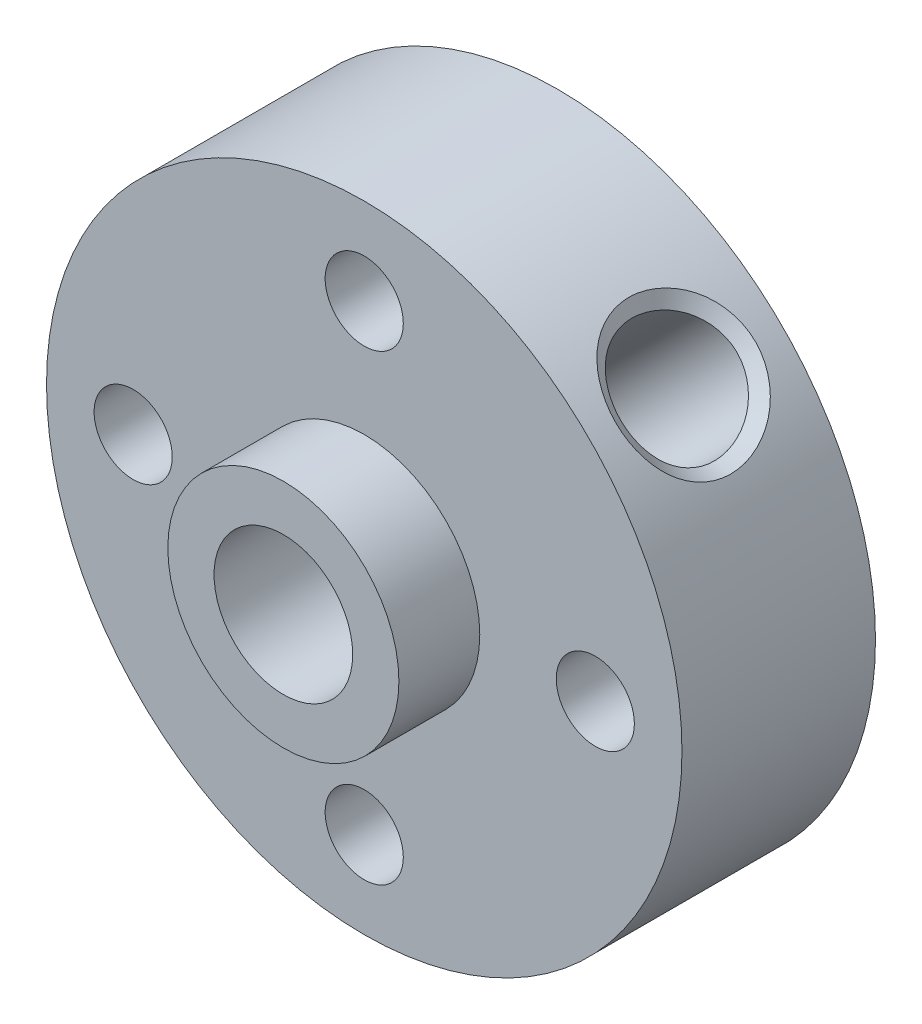
ISO-10303-21;
HEADER;
FILE_DESCRIPTION(('STEP AP214'),'2;1');
FILE_NAME('part.step','',(''),(''),'','','');
FILE_SCHEMA(('AUTOMOTIVE_DESIGN { 1 0 10303 214 1 1 1 1 }'));
ENDSEC;
DATA;
#1=APPLICATION_CONTEXT('core data for automotive mechanical design processes');
#2=APPLICATION_PROTOCOL_DEFINITION('international standard','automotive_design',2000,#1);
#3=PRODUCT_CONTEXT('',#1,'mechanical');
#4=PRODUCT('Part','Part','',(#3));
#5=PRODUCT_RELATED_PRODUCT_CATEGORY('part','',(#4));
#6=PRODUCT_DEFINITION_FORMATION('','',#4);
#7=PRODUCT_DEFINITION_CONTEXT('part definition',#1,'design');
#8=PRODUCT_DEFINITION('design','',#6,#7);
#9=PRODUCT_DEFINITION_SHAPE('','',#8);
#10=(LENGTH_UNIT() NAMED_UNIT(*) SI_UNIT(.MILLI.,.METRE.));
#11=(NAMED_UNIT(*) PLANE_ANGLE_UNIT() SI_UNIT($,.RADIAN.));
#12=(NAMED_UNIT(*) SI_UNIT($,.STERADIAN.) SOLID_ANGLE_UNIT());
#13=UNCERTAINTY_MEASURE_WITH_UNIT(LENGTH_MEASURE(1.E-05),#10,'distance_accuracy_value','');
#14=(GEOMETRIC_REPRESENTATION_CONTEXT(3) GLOBAL_UNCERTAINTY_ASSIGNED_CONTEXT((#13)) GLOBAL_UNIT_ASSIGNED_CONTEXT((#10,
#11,#12)) REPRESENTATION_CONTEXT('',''));
#15=CARTESIAN_POINT('',(0.,0.,0.));
#16=DIRECTION('',(0.,0.,1.));
#17=DIRECTION('',(1.,0.,0.));
#18=AXIS2_PLACEMENT_3D('',#15,#16,#17);
#19=CARTESIAN_POINT('',(0.,0.,3.35));
#20=DIRECTION('',(0.,0.,1.));
#21=DIRECTION('',(1.,0.,0.));
#22=AXIS2_PLACEMENT_3D('',#19,#20,#21);
#23=PLANE('',#22);
#24=CARTESIAN_POINT('',(0.,8.,3.35));
#25=DIRECTION('',(0.,0.,1.));
#26=DIRECTION('',(1.,0.,0.));
#27=AXIS2_PLACEMENT_3D('',#24,#25,#26);
#28=CIRCLE('',#27,1.35254999999999);
#29=CARTESIAN_POINT('',(1.35254999999999,8.,3.35));
#30=VERTEX_POINT('',#29);
#31=EDGE_CURVE('E180',#30,#30,#28,.T.);
#32=ORIENTED_EDGE('',*,*,#31,.F.);
#33=EDGE_LOOP('',(#32));
#34=FACE_BOUND('',#33,.T.);
#35=CARTESIAN_POINT('',(-8.,0.,3.35));
#36=DIRECTION('',(0.,0.,1.));
#37=DIRECTION('',(1.,0.,0.));
#38=AXIS2_PLACEMENT_3D('',#35,#36,#37);
#39=CIRCLE('',#38,1.35254999999999);
#40=CARTESIAN_POINT('',(-6.64745000000001,0.,3.35));
#41=VERTEX_POINT('',#40);
#42=EDGE_CURVE('E172',#41,#41,#39,.T.);
#43=ORIENTED_EDGE('',*,*,#42,.F.);
#44=EDGE_LOOP('',(#43));
#45=FACE_BOUND('',#44,.T.);
#46=CARTESIAN_POINT('',(8.,0.,3.35));
#47=DIRECTION('',(0.,0.,1.));
#48=DIRECTION('',(1.,0.,0.));
#49=AXIS2_PLACEMENT_3D('',#46,#47,#48);
#50=CIRCLE('',#49,1.35254999999999);
#51=CARTESIAN_POINT('',(9.35254999999999,0.,3.35));
#52=VERTEX_POINT('',#51);
#53=EDGE_CURVE('E167',#52,#52,#50,.T.);
#54=ORIENTED_EDGE('',*,*,#53,.F.);
#55=EDGE_LOOP('',(#54));
#56=FACE_BOUND('',#55,.T.);
#57=CARTESIAN_POINT('',(0.,-8.,3.35));
#58=DIRECTION('',(0.,0.,1.));
#59=DIRECTION('',(1.,0.,0.));
#60=AXIS2_PLACEMENT_3D('',#57,#58,#59);
#61=CIRCLE('',#60,1.35254999999999);
#62=CARTESIAN_POINT('',(1.35254999999999,-8.,3.35));
#63=VERTEX_POINT('',#62);
#64=EDGE_CURVE('E94',#63,#63,#61,.T.);
#65=ORIENTED_EDGE('',*,*,#64,.F.);
#66=EDGE_LOOP('',(#65));
#67=FACE_BOUND('',#66,.T.);
#68=CARTESIAN_POINT('',(0.,0.,3.35));
#69=DIRECTION('',(0.,0.,1.));
#70=DIRECTION('',(1.,0.,0.));
#71=AXIS2_PLACEMENT_3D('',#68,#69,#70);
#72=CIRCLE('',#71,11.);
#73=CARTESIAN_POINT('',(11.,0.,3.35));
#74=VERTEX_POINT('',#73);
#75=EDGE_CURVE('E55',#74,#74,#72,.T.);
#76=ORIENTED_EDGE('',*,*,#75,.T.);
#77=EDGE_LOOP('',(#76));
#78=FACE_BOUND('',#77,.T.);
#79=CARTESIAN_POINT('',(0.,0.,3.35));
#80=DIRECTION('',(0.,0.,1.));
#81=DIRECTION('',(1.,0.,0.));
#82=AXIS2_PLACEMENT_3D('',#79,#80,#81);
#83=CIRCLE('',#82,4.);
#84=CARTESIAN_POINT('',(4.,0.,3.35));
#85=VERTEX_POINT('',#84);
#86=EDGE_CURVE('E63',#85,#85,#83,.T.);
#87=ORIENTED_EDGE('',*,*,#86,.F.);
#88=EDGE_LOOP('',(#87));
#89=FACE_BOUND('',#88,.T.);
#90=ADVANCED_FACE('F33',(#34,#45,#56,#67,#78,#89),#23,.T.);
#91=CARTESIAN_POINT('',(0.,0.,-3.35));
#92=DIRECTION('',(0.,0.,1.));
#93=DIRECTION('',(1.,0.,0.));
#94=AXIS2_PLACEMENT_3D('',#91,#92,#93);
#95=CYLINDRICAL_SURFACE('',#94,11.);
#96=CARTESIAN_POINT('',(5.80850921114971,9.34137145948008,0.));
#97=CARTESIAN_POINT('',(5.80860175270186,9.34130684226353,0.637752239425175));
#98=CARTESIAN_POINT('',(6.04841944563921,9.19795689630476,1.26506432985481));
#99=CARTESIAN_POINT('',(6.80772994268232,8.6547578245762,2.15935304443139));
#100=CARTESIAN_POINT('',(7.31255506753503,8.24383991985221,2.42181611028021));
#101=CARTESIAN_POINT('',(8.24208780154511,7.31421539613682,2.42137394363942));
#102=CARTESIAN_POINT('',(8.65342910417239,6.80927509037896,2.16023058528546));
#103=CARTESIAN_POINT('',(9.19833006953286,6.04820111625002,1.26575073384544));
#104=CARTESIAN_POINT('',(9.34130756360717,5.80859981124356,0.640244269694805));
#105=CARTESIAN_POINT('',(9.34143535072447,5.80841861849954,-0.63996115444347));
#106=CARTESIAN_POINT('',(9.19862099961547,6.04773368941902,-1.26485137218771));
#107=CARTESIAN_POINT('',(8.65403117260026,6.8085025567722,-2.15966842361701));
#108=CARTESIAN_POINT('',(8.24214650834188,7.31418190369823,-2.42143639363605));
#109=CARTESIAN_POINT('',(7.31242801405934,8.24394174367863,-2.42175361413117));
#110=CARTESIAN_POINT('',(6.80825671047602,8.65433029295559,-2.15959971653594));
#111=CARTESIAN_POINT('',(6.04869975760828,9.19780320357039,-1.26576913530237));
#112=CARTESIAN_POINT('',(5.80841666959756,9.34143607669663,-0.637752239425176));
#113=CARTESIAN_POINT('',(5.80850921114971,9.34137145948008,0.));
#114=B_SPLINE_CURVE_WITH_KNOTS('',3,(#96,#97,#98,#99,#100,#101,#102,#103,#104,#105,#106,#107,
#108,#109,#110,#111,#112,#113),.UNSPECIFIED.,.T.,.F.,(4,2,2,2,2,2,2,2,4),(-3.18999496817969E-06,
0.00189587305523977,0.00379493610544773,0.00569399915565568,0.00759306220586363,
0.00949212525607159,0.0113911883062795,0.0132902513564875,0.0151893144066954),.UNSPECIFIED.);
#115=CARTESIAN_POINT('',(5.80850921114971,9.34137145948008,0.));
#116=VERTEX_POINT('',#115);
#117=EDGE_CURVE('E10',#116,#116,#114,.F.);
#118=ORIENTED_EDGE('',*,*,#117,.T.);
#119=EDGE_LOOP('',(#118));
#120=FACE_BOUND('',#119,.T.);
#121=CARTESIAN_POINT('',(0.,0.,-3.35));
#122=DIRECTION('',(0.,0.,1.));
#123=DIRECTION('',(1.,0.,0.));
#124=AXIS2_PLACEMENT_3D('',#121,#122,#123);
#125=CIRCLE('',#124,11.);
#126=CARTESIAN_POINT('',(11.,0.,-3.35));
#127=VERTEX_POINT('',#126);
#128=EDGE_CURVE('E50',#127,#127,#125,.T.);
#129=ORIENTED_EDGE('',*,*,#128,.T.);
#130=EDGE_LOOP('',(#129));
#131=FACE_BOUND('',#130,.T.);
#132=ORIENTED_EDGE('',*,*,#75,.F.);
#133=EDGE_LOOP('',(#132));
#134=FACE_BOUND('',#133,.T.);
#135=ADVANCED_FACE('F109',(#120,#131,#134),#95,.T.);
#136=CARTESIAN_POINT('',(0.,0.,-3.35));
#137=DIRECTION('',(0.,0.,1.));
#138=DIRECTION('',(1.,0.,0.));
#139=AXIS2_PLACEMENT_3D('',#136,#137,#138);
#140=PLANE('',#139);
#141=CARTESIAN_POINT('',(0.,8.,-3.35));
#142=DIRECTION('',(0.,0.,1.));
#143=DIRECTION('',(1.,0.,0.));
#144=AXIS2_PLACEMENT_3D('',#141,#142,#143);
#145=CIRCLE('',#144,1.35255);
#146=CARTESIAN_POINT('',(1.35255,8.,-3.35));
#147=VERTEX_POINT('',#146);
#148=EDGE_CURVE('E183',#147,#147,#145,.T.);
#149=ORIENTED_EDGE('',*,*,#148,.T.);
#150=EDGE_LOOP('',(#149));
#151=FACE_BOUND('',#150,.T.);
#152=CARTESIAN_POINT('',(-8.,0.,-3.35));
#153=DIRECTION('',(0.,0.,1.));
#154=DIRECTION('',(1.,0.,0.));
#155=AXIS2_PLACEMENT_3D('',#152,#153,#154);
#156=CIRCLE('',#155,1.35255);
#157=CARTESIAN_POINT('',(-6.64745,0.,-3.35));
#158=VERTEX_POINT('',#157);
#159=EDGE_CURVE('E177',#158,#158,#156,.T.);
#160=ORIENTED_EDGE('',*,*,#159,.T.);
#161=EDGE_LOOP('',(#160));
#162=FACE_BOUND('',#161,.T.);
#163=CARTESIAN_POINT('',(8.,0.,-3.35));
#164=DIRECTION('',(0.,0.,1.));
#165=DIRECTION('',(1.,0.,0.));
#166=AXIS2_PLACEMENT_3D('',#163,#164,#165);
#167=CIRCLE('',#166,1.35255);
#168=CARTESIAN_POINT('',(9.35255,0.,-3.35));
#169=VERTEX_POINT('',#168);
#170=EDGE_CURVE('E164',#169,#169,#167,.T.);
#171=ORIENTED_EDGE('',*,*,#170,.T.);
#172=EDGE_LOOP('',(#171));
#173=FACE_BOUND('',#172,.T.);
#174=CARTESIAN_POINT('',(0.,-8.,-3.35));
#175=DIRECTION('',(0.,0.,1.));
#176=DIRECTION('',(1.,0.,0.));
#177=AXIS2_PLACEMENT_3D('',#174,#175,#176);
#178=CIRCLE('',#177,1.35255);
#179=CARTESIAN_POINT('',(1.35255,-8.,-3.35));
#180=VERTEX_POINT('',#179);
#181=EDGE_CURVE('E169',#180,#180,#178,.T.);
#182=ORIENTED_EDGE('',*,*,#181,.T.);
#183=EDGE_LOOP('',(#182));
#184=FACE_BOUND('',#183,.T.);
#185=CARTESIAN_POINT('',(0.,0.,-3.35));
#186=DIRECTION('',(0.,0.,1.));
#187=DIRECTION('',(1.,0.,0.));
#188=AXIS2_PLACEMENT_3D('',#185,#186,#187);
#189=CIRCLE('',#188,2.4);
#190=CARTESIAN_POINT('',(2.4,0.,-3.35));
#191=VERTEX_POINT('',#190);
#192=EDGE_CURVE('E96',#191,#191,#189,.T.);
#193=ORIENTED_EDGE('',*,*,#192,.T.);
#194=EDGE_LOOP('',(#193));
#195=FACE_BOUND('',#194,.T.);
#196=ORIENTED_EDGE('',*,*,#128,.F.);
#197=EDGE_LOOP('',(#196));
#198=FACE_BOUND('',#197,.T.);
#199=ADVANCED_FACE('F115',(#151,#162,#173,#184,#195,#198),#140,.F.);
#200=CARTESIAN_POINT('',(0.,0.,6.15));
#201=DIRECTION('',(0.,0.,-1.));
#202=DIRECTION('',(-1.,0.,0.));
#203=AXIS2_PLACEMENT_3D('',#200,#201,#202);
#204=CYLINDRICAL_SURFACE('',#203,4.);
#205=CARTESIAN_POINT('',(0.,0.,6.15));
#206=DIRECTION('',(0.,0.,1.));
#207=DIRECTION('',(1.,0.,0.));
#208=AXIS2_PLACEMENT_3D('',#205,#206,#207);
#209=CIRCLE('',#208,4.);
#210=CARTESIAN_POINT('',(4.,0.,6.15));
#211=VERTEX_POINT('',#210);
#212=EDGE_CURVE('E60',#211,#211,#209,.T.);
#213=ORIENTED_EDGE('',*,*,#212,.F.);
#214=EDGE_LOOP('',(#213));
#215=FACE_BOUND('',#214,.T.);
#216=ORIENTED_EDGE('',*,*,#86,.T.);
#217=EDGE_LOOP('',(#216));
#218=FACE_BOUND('',#217,.T.);
#219=ADVANCED_FACE('F106',(#215,#218),#204,.T.);
#220=CARTESIAN_POINT('',(0.,0.,6.15));
#221=DIRECTION('',(0.,0.,1.));
#222=DIRECTION('',(1.,0.,0.));
#223=AXIS2_PLACEMENT_3D('',#220,#221,#222);
#224=PLANE('',#223);
#225=CARTESIAN_POINT('',(0.,0.,6.15));
#226=DIRECTION('',(0.,0.,1.));
#227=DIRECTION('',(1.,0.,0.));
#228=AXIS2_PLACEMENT_3D('',#225,#226,#227);
#229=CIRCLE('',#228,2.4);
#230=CARTESIAN_POINT('',(2.4,0.,6.15));
#231=VERTEX_POINT('',#230);
#232=EDGE_CURVE('E93',#231,#231,#229,.T.);
#233=ORIENTED_EDGE('',*,*,#232,.F.);
#234=EDGE_LOOP('',(#233));
#235=FACE_BOUND('',#234,.T.);
#236=ORIENTED_EDGE('',*,*,#212,.T.);
#237=EDGE_LOOP('',(#236));
#238=FACE_BOUND('',#237,.T.);
#239=ADVANCED_FACE('F198',(#235,#238),#224,.T.);
#240=CARTESIAN_POINT('',(0.,0.,-3.35));
#241=DIRECTION('',(0.,0.,1.));
#242=DIRECTION('',(1.,0.,0.));
#243=AXIS2_PLACEMENT_3D('',#240,#241,#242);
#244=CYLINDRICAL_SURFACE('',#243,2.4);
#245=CARTESIAN_POINT('',(2.4,0.,-1.09433655243713));
#246=CARTESIAN_POINT('',(2.39999549677408,0.0918258954439171,-1.19504751534314));
#247=CARTESIAN_POINT('',(2.39468581076607,0.190550179248583,-1.28957303433403));
#248=CARTESIAN_POINT('',(2.369167262945,0.397415738785247,-1.46565348204902));
#249=CARTESIAN_POINT('',(2.3489510225727,0.505561654721847,-1.54720196298737));
#250=CARTESIAN_POINT('',(2.2961878181119,0.704092495070362,-1.67920338801804));
#251=CARTESIAN_POINT('',(2.26712119925325,0.793438846857645,-1.73259020418202));
#252=CARTESIAN_POINT('',(2.19596057742005,0.973168402780957,-1.82757870174769));
#253=CARTESIAN_POINT('',(2.15388927549888,1.06354953789234,-1.86920067941086));
#254=CARTESIAN_POINT('',(2.06347262158125,1.22863264617417,-1.9330857225613));
#255=CARTESIAN_POINT('',(2.01706533869137,1.30362198706416,-1.9573340458837));
#256=CARTESIAN_POINT('',(1.91466986499154,1.44982281978823,-1.99438783770254));
#257=CARTESIAN_POINT('',(1.85868616144868,1.52103606062612,-2.00719864812017));
#258=CARTESIAN_POINT('',(1.73814609656906,1.65745379384576,-2.0205531845462));
#259=CARTESIAN_POINT('',(1.67356653390496,1.72264118497492,-2.02106300470413));
#260=CARTESIAN_POINT('',(1.53797914495771,1.84470717951664,-2.00969277868068));
#261=CARTESIAN_POINT('',(1.46697072364594,1.9015850125548,-1.9978115845654));
#262=CARTESIAN_POINT('',(1.32399721547764,2.00360520801464,-1.96319299119062));
#263=CARTESIAN_POINT('',(1.25219165125774,2.04913408506368,-1.94092229674205));
#264=CARTESIAN_POINT('',(1.1070014698224,2.13108215689419,-1.88690050053406));
#265=CARTESIAN_POINT('',(1.03361612775899,2.16749706881726,-1.85514495694595));
#266=CARTESIAN_POINT('',(0.85994663818204,2.2433175863967,-1.77017444356637));
#267=CARTESIAN_POINT('',(0.759734181670304,2.27886397472941,-1.7133651848094));
#268=CARTESIAN_POINT('',(0.56309632934406,2.33525777989147,-1.5872394707011));
#269=CARTESIAN_POINT('',(0.46667799556754,2.35607890720128,-1.51790092197272));
#270=CARTESIAN_POINT('',(0.278879458097049,2.38566615723369,-1.36749948627123));
#271=CARTESIAN_POINT('',(0.187608194494958,2.39422838462626,-1.28626252954375));
#272=CARTESIAN_POINT('',(0.0146327458766225,2.4015091621865,-1.11377589004947));
#273=CARTESIAN_POINT('',(-0.0670737997805187,2.40023014646564,-1.02252868869816));
#274=CARTESIAN_POINT('',(-0.197962775585905,2.39248322236102,-0.853801778164708));
#275=CARTESIAN_POINT('',(-0.250165267217843,2.38739547558387,-0.778599565121305));
#276=CARTESIAN_POINT('',(-0.343798396458399,2.37571350999456,-0.621820492340616));
#277=CARTESIAN_POINT('',(-0.385247938896625,2.3691219738931,-0.540255152704692));
#278=CARTESIAN_POINT('',(-0.443801011289591,2.35874751402488,-0.393099704378681));
#279=CARTESIAN_POINT('',(-0.464441983483004,2.35468224015414,-0.328965581597192));
#280=CARTESIAN_POINT('',(-0.495011359266389,2.34844961432166,-0.19815347061405));
#281=CARTESIAN_POINT('',(-0.504965458352082,2.34627771231763,-0.131481985112074));
#282=CARTESIAN_POINT('',(-0.512708670349231,2.34460061057782,0.0030122508888446));
#283=CARTESIAN_POINT('',(-0.510428954605099,2.34511049853825,0.0708393705218476));
#284=CARTESIAN_POINT('',(-0.493930084776009,2.34863671309948,0.204991368188147));
#285=CARTESIAN_POINT('',(-0.479690814832164,2.35165726252071,0.271313521732825));
#286=CARTESIAN_POINT('',(-0.435142961394895,2.36036040022229,0.421511686914182));
#287=CARTESIAN_POINT('',(-0.401156031918268,2.36658493491141,0.504233980851543));
#288=CARTESIAN_POINT('',(-0.320904833138461,2.37879471937154,0.663600485910364));
#289=CARTESIAN_POINT('',(-0.274596562429394,2.38477902129586,0.740221608784293));
#290=CARTESIAN_POINT('',(-0.184045497955121,2.39327060162296,0.871956115918708));
#291=CARTESIAN_POINT('',(-0.14144280205973,2.39624587375274,0.92818754157932));
#292=CARTESIAN_POINT('',(-0.0519398420575724,2.39985704074935,1.03721493488172));
#293=CARTESIAN_POINT('',(-0.00503725171330568,2.40049166158102,1.09000901619721));
#294=CARTESIAN_POINT('',(0.14083402262038,2.39782922251128,1.2433524644827));
#295=CARTESIAN_POINT('',(0.245054200715936,2.38997684845191,1.33898500860759));
#296=CARTESIAN_POINT('',(0.447019822375516,2.35989329853952,1.50315571365506));
#297=CARTESIAN_POINT('',(0.543547348000516,2.33988782761346,1.57361261542774));
#298=CARTESIAN_POINT('',(0.740642674440521,2.28513716448287,1.70200961270045));
#299=CARTESIAN_POINT('',(0.841202317487256,2.25042049607641,1.75997360452849));
#300=CARTESIAN_POINT('',(1.02242016523822,2.1730852861859,1.85033396919466));
#301=CARTESIAN_POINT('',(1.10297091238072,2.13350512786098,1.88553226766972));
#302=CARTESIAN_POINT('',(1.26214331511997,2.04336388088066,1.94448891886619));
#303=CARTESIAN_POINT('',(1.34076609081766,1.99280934475451,1.96825407092077));
#304=CARTESIAN_POINT('',(1.49377030482187,1.88087154204424,2.00293964410296));
#305=CARTESIAN_POINT('',(1.56812497854421,1.81942812536219,2.01378599005086));
#306=CARTESIAN_POINT('',(1.70921571925083,1.68757030017141,2.02154777923062));
#307=CARTESIAN_POINT('',(1.77595394373701,1.6171584441599,2.01846717762351));
#308=CARTESIAN_POINT('',(1.89385111836663,1.47680439608037,1.99956328386563));
#309=CARTESIAN_POINT('',(1.94588020475627,1.40742154143652,1.98494538809918));
#310=CARTESIAN_POINT('',(2.04097872683706,1.26558348310351,1.94534517584651));
#311=CARTESIAN_POINT('',(2.08404680312482,1.19312781526647,1.9203612885371));
#312=CARTESIAN_POINT('',(2.16320019292288,1.0431445602755,1.85962583643449));
#313=CARTESIAN_POINT('',(2.19876985386715,0.965557523070692,1.82335672335069));
#314=CARTESIAN_POINT('',(2.26029878185005,0.811154867897669,1.74214078223415));
#315=CARTESIAN_POINT('',(2.28625208715777,0.734339757100534,1.69718859724716));
#316=CARTESIAN_POINT('',(2.33982449451597,0.546611683105258,1.57649497874268));
#317=CARTESIAN_POINT('',(2.36225386192885,0.437046456555988,1.49633684053456));
#318=CARTESIAN_POINT('',(2.39163239097249,0.226704657923942,1.32247275514879));
#319=CARTESIAN_POINT('',(2.39854112053262,0.125951696152554,1.2287320986696));
#320=CARTESIAN_POINT('',(2.40085987505948,-0.0489525954614862,1.04283976476142));
#321=CARTESIAN_POINT('',(2.39775764782871,-0.124850952535787,0.952337558210139));
#322=CARTESIAN_POINT('',(2.38658778617655,-0.262497870449791,0.761453378495307));
#323=CARTESIAN_POINT('',(2.3785359102636,-0.324290487785901,0.66110360636626));
#324=CARTESIAN_POINT('',(2.36576243399885,-0.405117869885077,0.492845705525591));
#325=CARTESIAN_POINT('',(2.36102335039097,-0.431309408345181,0.428420074253314));
#326=CARTESIAN_POINT('',(2.35293124174405,-0.473473491997229,0.29627609547871));
#327=CARTESIAN_POINT('',(2.34957463084623,-0.48947253426043,0.22856678224992));
#328=CARTESIAN_POINT('',(2.34539787602257,-0.509143249846498,0.0905198234930237));
#329=CARTESIAN_POINT('',(2.34460333538734,-0.51269052096264,0.0201627131590107));
#330=CARTESIAN_POINT('',(2.34595711321856,-0.506447675999942,-0.119965883355894));
#331=CARTESIAN_POINT('',(2.34810864156523,-0.496643012426334,-0.189736647309032));
#332=CARTESIAN_POINT('',(2.35503790579702,-0.462739687458018,-0.33781243559993));
#333=CARTESIAN_POINT('',(2.36019423804237,-0.43652723392848,-0.41559666127126));
#334=CARTESIAN_POINT('',(2.37117600828219,-0.372259224836509,-0.566045820751056));
#335=CARTESIAN_POINT('',(2.37700306318634,-0.334174655408325,-0.63869767231639));
#336=CARTESIAN_POINT('',(2.38730091370058,-0.250126569928135,-0.777813003742594));
#337=CARTESIAN_POINT('',(2.39179064743644,-0.204289084689466,-0.844352640923328));
#338=CARTESIAN_POINT('',(2.39814115530881,-0.106441244542942,-0.972763995961084));
#339=CARTESIAN_POINT('',(2.40000266942605,-0.0544326316013623,-1.03463702306603));
#340=CARTESIAN_POINT('',(2.4,0.,-1.09433655243713));
#341=B_SPLINE_CURVE_WITH_KNOTS('',3,(#245,#246,#247,#248,#249,#250,#251,#252,#253,#254,#255,
#256,#257,#258,#259,#260,#261,#262,#263,#264,#265,#266,#267,#268,#269,#270,#271,#272,#273,#274,
#275,#276,#277,#278,#279,#280,#281,#282,#283,#284,#285,#286,#287,#288,#289,#290,#291,#292,#293,
#294,#295,#296,#297,#298,#299,#300,#301,#302,#303,#304,#305,#306,#307,#308,#309,#310,#311,#312,
#313,#314,#315,#316,#317,#318,#319,#320,#321,#322,#323,#324,#325,#326,#327,#328,#329,#330,#331,
#332,#333,#334,#335,#336,#337,#338,#339,#340),.UNSPECIFIED.,.T.,.F.,(4,2,2,2,2,2,2,2,2,2,2,2,2,
2,2,2,2,2,2,2,2,2,2,2,2,2,2,2,2,2,2,2,2,2,2,2,2,2,2,2,2,2,2,2,2,2,2,4),(0.,0.408620608176932,
0.817443614373309,1.1404264137415,1.46284856622567,1.73605316367794,2.00913009333466,
2.28295963321007,2.5568145435783,2.81940371981475,3.08211606193237,3.44181866032331,
3.80216183807987,4.16843142381795,4.53461042015299,4.80905621129592,5.08301617653533,
5.28476544047608,5.48602852499472,5.68842511853597,5.89116282459916,6.15860978620005,
6.42702496835601,6.63858657190233,6.85026331313678,7.27316949450547,7.63537214187038,
7.99687569858261,8.28493383801785,8.57282045582691,8.86234996075639,9.15179724638664,
9.41446328505672,9.67716914169123,9.95435338849279,10.2317091913317,10.6423111511957,
11.0539815162958,11.4074432515359,11.7597854352766,11.9682718477665,12.176214029697,
12.3862278827444,12.5964707378899,12.8418267592228,13.0877871619727,13.3300778611367,
13.5723003292334),.UNSPECIFIED.);
#342=CARTESIAN_POINT('',(2.4,0.,-1.09433655243713));
#343=VERTEX_POINT('',#342);
#344=EDGE_CURVE('E87',#343,#343,#341,.T.);
#345=ORIENTED_EDGE('',*,*,#344,.T.);
#346=EDGE_LOOP('',(#345));
#347=FACE_BOUND('',#346,.T.);
#348=ORIENTED_EDGE('',*,*,#192,.F.);
#349=EDGE_LOOP('',(#348));
#350=FACE_BOUND('',#349,.T.);
#351=ORIENTED_EDGE('',*,*,#232,.T.);
#352=EDGE_LOOP('',(#351));
#353=FACE_BOUND('',#352,.T.);
#354=ADVANCED_FACE('F81',(#347,#350,#353),#244,.F.);
#355=CARTESIAN_POINT('',(7.77817459305204,7.77817459305201,0.));
#356=DIRECTION('',(0.707106781186549,0.707106781186546,0.));
#357=DIRECTION('',(-0.707106781186546,0.707106781186549,0.));
#358=AXIS2_PLACEMENT_3D('',#355,#356,#357);
#359=CYLINDRICAL_SURFACE('',#358,2.01929999999999);
#360=CARTESIAN_POINT('',(5.91506401697902,8.77078546347898,0.));
#361=CARTESIAN_POINT('',(5.91505848231523,8.77078895441069,-0.0332110676749002));
#362=CARTESIAN_POINT('',(5.91584250371787,8.77036908136088,-0.0664205027333983));
#363=CARTESIAN_POINT('',(5.91894801804012,8.7686844720424,-0.132706000824386));
#364=CARTESIAN_POINT('',(5.9212676546673,8.76742075581778,-0.165782176435799));
#365=CARTESIAN_POINT('',(5.92740096477233,8.76405141279833,-0.231730396913026));
#366=CARTESIAN_POINT('',(5.93121367555311,8.76194632847871,-0.264602559475331));
#367=CARTESIAN_POINT('',(5.94028892447994,8.75689761117119,-0.33007339450581));
#368=CARTESIAN_POINT('',(5.94555114052323,8.7539541644756,-0.362672126078199));
#369=CARTESIAN_POINT('',(5.95748172497235,8.74723181556498,-0.427526437618046));
#370=CARTESIAN_POINT('',(5.96415019887331,8.74345285066973,-0.45978199165009));
#371=CARTESIAN_POINT('',(5.97884975539384,8.73506249034033,-0.523880394046921));
#372=CARTESIAN_POINT('',(5.98688119889341,8.73045087442044,-0.55572313069829));
#373=CARTESIAN_POINT('',(6.00426333819006,8.72039813550142,-0.618926309415734));
#374=CARTESIAN_POINT('',(6.01361451659092,8.71495670899629,-0.650286570375662));
#375=CARTESIAN_POINT('',(6.03359289306655,8.70324720139476,-0.712455190591758));
#376=CARTESIAN_POINT('',(6.04422059736454,8.69697879224988,-0.743263325292279));
#377=CARTESIAN_POINT('',(6.06670888670971,8.68361811087547,-0.80425805175125));
#378=CARTESIAN_POINT('',(6.07856993563723,8.67652552854269,-0.834444404496168));
#379=CARTESIAN_POINT('',(6.10348184418441,8.66151925847353,-0.894125891486483));
#380=CARTESIAN_POINT('',(6.1165330880074,8.65360530547822,-0.923620798638439));
#381=CARTESIAN_POINT('',(6.14378232701951,8.63695899466252,-0.981849692064878));
#382=CARTESIAN_POINT('',(6.15798061459986,8.62822642807899,-1.01058348182968));
#383=CARTESIAN_POINT('',(6.18748098358666,8.6099456924559,-1.0672204054046));
#384=CARTESIAN_POINT('',(6.20278327541986,8.60039736786602,-1.09512337941919));
#385=CARTESIAN_POINT('',(6.23444834486617,8.58048749877547,-1.15002897367341));
#386=CARTESIAN_POINT('',(6.25081127954806,8.57012583378044,-1.1770314596605));
#387=CARTESIAN_POINT('',(6.28455556770699,8.54859326407029,-1.23006622575013));
#388=CARTESIAN_POINT('',(6.30193706947596,8.53742224146554,-1.25609836367373));
#389=CARTESIAN_POINT('',(6.33767164204863,8.51426907303072,-1.30712323462615));
#390=CARTESIAN_POINT('',(6.35602490834892,8.50228676385234,-1.33211575668861));
#391=CARTESIAN_POINT('',(6.39367379710447,8.47753119815556,-1.38098995191832));
#392=CARTESIAN_POINT('',(6.41296973283744,8.46475767831074,-1.40487125057306));
#393=CARTESIAN_POINT('',(6.45239380966425,8.43836765389059,-1.45144277207452));
#394=CARTESIAN_POINT('',(6.47252179241437,8.42475130946692,-1.47413321969915));
#395=CARTESIAN_POINT('',(6.51347588006849,8.39664993352501,-1.51827896365428));
#396=CARTESIAN_POINT('',(6.53430150189428,8.38216549784592,-1.53973508781516));
#397=CARTESIAN_POINT('',(6.57659692078657,8.35237560191873,-1.58137915482344));
#398=CARTESIAN_POINT('',(6.59806639414691,8.33707055129587,-1.60156771966927));
#399=CARTESIAN_POINT('',(6.64157796071986,8.30566497179513,-1.6406458230446));
#400=CARTESIAN_POINT('',(6.66361982921346,8.28956475292207,-1.65953586105512));
#401=CARTESIAN_POINT('',(6.70820943365554,8.25660020779171,-1.69598536565465));
#402=CARTESIAN_POINT('',(6.73075699607695,8.23973614168034,-1.71354527988382));
#403=CARTESIAN_POINT('',(6.77629000761415,8.20527364445819,-1.74730308237523));
#404=CARTESIAN_POINT('',(6.7992753094278,8.18767545809095,-1.76350141922007));
#405=CARTESIAN_POINT('',(6.84561618019305,8.15177485327989,-1.79450451369917));
#406=CARTESIAN_POINT('',(6.86897161775489,8.13347268158226,-1.80930975345407));
#407=CARTESIAN_POINT('',(6.915985056941,8.09619410943874,-1.8374950782937));
#408=CARTESIAN_POINT('',(6.93964294335846,8.07721796109372,-1.8508756889275));
#409=CARTESIAN_POINT('',(6.98719359976604,8.03862146663375,-1.87618016635322));
#410=CARTESIAN_POINT('',(7.01108627669854,8.01900136905856,-1.88810458698167));
#411=CARTESIAN_POINT('',(7.05903882080187,7.9791470079832,-1.91046511062842));
#412=CARTESIAN_POINT('',(7.08309862402777,7.95891297037338,-1.92090175318898));
#413=CARTESIAN_POINT('',(7.13131772267692,7.91786078233943,-1.94025519102211));
#414=CARTESIAN_POINT('',(7.15547698625861,7.89704280807245,-1.94917243903047));
#415=CARTESIAN_POINT('',(7.20382730656836,7.85485282469413,-1.96545562647138));
#416=CARTESIAN_POINT('',(7.2280183572575,7.83348090947039,-1.97282182688519));
#417=CARTESIAN_POINT('',(7.27636455934795,7.79021315756591,-1.9859715835014));
#418=CARTESIAN_POINT('',(7.30051970910261,7.76831729759628,-1.99175506921085));
#419=CARTESIAN_POINT('',(7.34872645183661,7.72403178920513,-2.0017081311534));
#420=CARTESIAN_POINT('',(7.37277800466266,7.70164196687641,-2.00587712907822));
#421=CARTESIAN_POINT('',(7.42070990754527,7.65639875033492,-2.01257039611203));
#422=CARTESIAN_POINT('',(7.4445901076154,7.63354500443549,-2.01509336544913));
#423=CARTESIAN_POINT('',(7.49211187188735,7.58740398851408,-2.01846297530972));
#424=CARTESIAN_POINT('',(7.51575306944566,7.56411617370423,-2.01930734284276));
#425=CARTESIAN_POINT('',(7.56268537381162,7.51718143523516,-2.01929214610317));
#426=CARTESIAN_POINT('',(7.58597640723569,7.49353443833365,-2.01843222954557));
#427=CARTESIAN_POINT('',(7.63213269087668,7.44599278654125,-2.01503739250119));
#428=CARTESIAN_POINT('',(7.65499833438957,7.42209839582681,-2.01250410727608));
#429=CARTESIAN_POINT('',(7.70027314745174,7.37413068840908,-2.00579376995032));
#430=CARTESIAN_POINT('',(7.72268252506741,7.35005746041974,-2.00161748558656));
#431=CARTESIAN_POINT('',(7.76701398076268,7.30180085174933,-1.99165308065752));
#432=CARTESIAN_POINT('',(7.78893610238858,7.27761748114641,-1.98586510476038));
#433=CARTESIAN_POINT('',(7.83226222533887,7.22920923113277,-1.97270874422235));
#434=CARTESIAN_POINT('',(7.85366613690357,7.20498434529831,-1.96534008793903));
#435=CARTESIAN_POINT('',(7.89592497299628,7.15656166922531,-1.94905366064103));
#436=CARTESIAN_POINT('',(7.91677971060388,7.13236389082919,-1.94013536983414));
#437=CARTESIAN_POINT('',(7.95790929380116,7.08406400516905,-1.92078078423956));
#438=CARTESIAN_POINT('',(7.97818389178885,7.05996194242695,-1.91034385253155));
#439=CARTESIAN_POINT('',(8.01812224950333,7.0119220569662,-1.88798297317344));
#440=CARTESIAN_POINT('',(8.03778573410585,6.98798431189647,-1.87605836754498));
#441=CARTESIAN_POINT('',(8.07647088550343,6.94034163726295,-1.85075303378894));
#442=CARTESIAN_POINT('',(8.09549227656628,6.91663681074191,-1.83737169026327));
#443=CARTESIAN_POINT('',(8.13286222382865,6.86952855499725,-1.80918371284058));
#444=CARTESIAN_POINT('',(8.15121052192307,6.84612524357941,-1.79437653992198));
#445=CARTESIAN_POINT('',(8.18720327904014,6.79968863480247,-1.76336770394078));
#446=CARTESIAN_POINT('',(8.20484750501894,6.7766554614392,-1.74716558467095));
#447=CARTESIAN_POINT('',(8.23940098478744,6.7310276756681,-1.71339764848219));
#448=CARTESIAN_POINT('',(8.25631002512714,6.70843319166702,-1.69583143959049));
#449=CARTESIAN_POINT('',(8.28936245658593,6.6637516328335,-1.65936614329798));
#450=CARTESIAN_POINT('',(8.30550563361525,6.64166470076171,-1.64046668682979));
#451=CARTESIAN_POINT('',(8.33699399859717,6.59806596681263,-1.6013657262551));
#452=CARTESIAN_POINT('',(8.35233893380897,6.57655434812705,-1.5811638142422));
#453=CARTESIAN_POINT('',(8.38220479917344,6.53417810328664,-1.53948894405403));
#454=CARTESIAN_POINT('',(8.39672538327565,6.51331375048719,-1.51801545970707));
#455=CARTESIAN_POINT('',(8.42489311596827,6.47228827852071,-1.47382811571226));
#456=CARTESIAN_POINT('',(8.43853973376537,6.45212759003506,-1.45111351751843));
#457=CARTESIAN_POINT('',(8.46498311220623,6.41264578919864,-1.40450223516731));
#458=CARTESIAN_POINT('',(8.47778006619722,6.39332448618789,-1.38060582211521));
#459=CARTESIAN_POINT('',(8.50257514167932,6.35563320480252,-1.33172197410269));
#460=CARTESIAN_POINT('',(8.51457408105178,6.33726225684295,-1.30673570103524));
#461=CARTESIAN_POINT('',(8.53775286994541,6.30150132680001,-1.25573829303499));
#462=CARTESIAN_POINT('',(8.54893337535543,6.28411056183229,-1.22972800503158));
#463=CARTESIAN_POINT('',(8.57047851389438,6.25035520776226,-1.17674891016928));
#464=CARTESIAN_POINT('',(8.58084366898023,6.23398996354728,-1.14978073283482));
#465=CARTESIAN_POINT('',(8.60075497666372,6.20232675855256,-1.09495202742266));
#466=CARTESIAN_POINT('',(8.61030156068652,6.1870282363647,-1.06709198016873));
#467=CARTESIAN_POINT('',(8.62857424193247,6.15754073429503,-1.01054566085374));
#468=CARTESIAN_POINT('',(8.6373007052626,6.14335125980824,-0.981859764999468));
#469=CARTESIAN_POINT('',(8.65393118322941,6.1161238432409,-0.923727827713147));
#470=CARTESIAN_POINT('',(8.66183551201454,6.10308546160268,-0.894282082037691));
#471=CARTESIAN_POINT('',(8.67681986647411,6.07820231388729,-0.834696503956039));
#472=CARTESIAN_POINT('',(8.68390015394207,6.06635716888693,-0.80455689565119));
#473=CARTESIAN_POINT('',(8.69723453927415,6.04390255145559,-0.743649643103452));
#474=CARTESIAN_POINT('',(8.70348883246058,6.03329278696552,-0.712882149330109));
#475=CARTESIAN_POINT('',(8.71516936551008,6.01335096704361,-0.650785178799456));
#476=CARTESIAN_POINT('',(8.72059570606081,6.00401875626216,-0.619455770895434));
#477=CARTESIAN_POINT('',(8.73061849592326,5.98667402839745,-0.556301032430909));
#478=CARTESIAN_POINT('',(8.73521490889622,5.97866156910146,-0.524475680221505));
#479=CARTESIAN_POINT('',(8.74357604893017,5.96399825071929,-0.460395119679619));
#480=CARTESIAN_POINT('',(8.74734054591038,5.95734776834859,-0.428139795039587));
#481=CARTESIAN_POINT('',(8.75403611517924,5.94545020513707,-0.363265361084164));
#482=CARTESIAN_POINT('',(8.75696669272247,5.94020395750586,-0.330646047697545));
#483=CARTESIAN_POINT('',(8.76199275794243,5.93115651464901,-0.265109684300492));
#484=CARTESIAN_POINT('',(8.76408740155927,5.92735678017527,-0.232192367504749));
#485=CARTESIAN_POINT('',(8.76744000846943,5.9212438787935,-0.166126063866235));
#486=CARTESIAN_POINT('',(8.768696681024,5.91893300538347,-0.132976798738429));
#487=CARTESIAN_POINT('',(8.77037188909036,5.91583898922573,-0.0665124282631949));
#488=CARTESIAN_POINT('',(8.77078857901006,5.91505921066461,-0.0331971186146498));
#489=CARTESIAN_POINT('',(8.77078234422555,5.91506882985746,0.033435419800891));
#490=CARTESIAN_POINT('',(8.77035936358662,5.91585833214921,0.0667526485478842));
#491=CARTESIAN_POINT('',(8.76867146473502,5.91897238819308,0.133224296589021));
#492=CARTESIAN_POINT('',(8.76740828879689,5.9212937652881,0.16637891006823));
#493=CARTESIAN_POINT('',(8.76404262761879,5.92742794695481,0.232458795725583));
#494=CARTESIAN_POINT('',(8.76194134378471,5.93123861650763,0.265384327842087));
#495=CARTESIAN_POINT('',(8.75690192757777,5.94030819641756,0.330939444120568));
#496=CARTESIAN_POINT('',(8.75396456516733,5.94556577413947,0.363569272205729));
#497=CARTESIAN_POINT('',(8.74725535386681,5.95748617552347,0.428466492217268));
#498=CARTESIAN_POINT('',(8.74348394143915,5.96414826411336,0.460734064467774));
#499=CARTESIAN_POINT('',(8.73510889001523,5.97883490576692,0.524840307220211));
#500=CARTESIAN_POINT('',(8.7305054388406,5.98685915131707,0.556679072780166));
#501=CARTESIAN_POINT('',(8.72046848535582,6.00422748816641,0.619861251959671));
#502=CARTESIAN_POINT('',(8.71503499303039,6.01357156358902,0.651204671532819));
#503=CARTESIAN_POINT('',(8.70334006221748,6.03353707477466,0.713329703342658));
#504=CARTESIAN_POINT('',(8.69707851221822,6.04415868256126,0.74411123927585));
#505=CARTESIAN_POINT('',(8.68372951263669,6.06663687147066,0.805046035453225));
#506=CARTESIAN_POINT('',(8.67664187185277,6.0784937384309,0.835199148335342));
#507=CARTESIAN_POINT('',(8.66164270405434,6.10340013586137,0.89481061365691));
#508=CARTESIAN_POINT('',(8.65373093354436,6.11645001867716,0.924268757591388));
#509=CARTESIAN_POINT('',(8.63708546101235,6.1437001608459,0.982423787635076));
#510=CARTESIAN_POINT('',(8.62835147637858,6.1579008155074,1.01112040761646));
#511=CARTESIAN_POINT('',(8.61006363456532,6.18741031938702,1.06768588347149));
#512=CARTESIAN_POINT('',(8.60050945492705,6.20271960408834,1.09555440793038));
#513=CARTESIAN_POINT('',(8.58058284492023,6.23440387837896,1.15039720437352));
#514=CARTESIAN_POINT('',(8.57021003759893,6.25077935830365,1.17737105617333));
#515=CARTESIAN_POINT('',(8.54864944445045,6.2845546751928,1.23035799961978));
#516=CARTESIAN_POINT('',(8.53746120026439,6.30195508720328,1.25637053833628));
#517=CARTESIAN_POINT('',(8.51426692329881,6.33773457120861,1.30736855221933));
#518=CARTESIAN_POINT('',(8.50226030619904,6.3561143403794,1.33235327267237));
#519=CARTESIAN_POINT('',(8.47744934140315,6.3938229438881,1.38122882200797));
#520=CARTESIAN_POINT('',(8.46464425050445,6.4131526587608,1.40511859474889));
#521=CARTESIAN_POINT('',(8.43818660196548,6.4526481078882,1.45171251711371));
#522=CARTESIAN_POINT('',(8.42453397317265,6.472813912287,1.47441656689831));
#523=CARTESIAN_POINT('',(8.39635830986087,6.51384425532208,1.51858066920913));
#524=CARTESIAN_POINT('',(8.38183596066717,6.53470823823056,1.5400416756681));
#525=CARTESIAN_POINT('',(8.351969724349,6.57707948460711,1.58168918955006));
#526=CARTESIAN_POINT('',(8.33662631249607,6.59858637281448,1.60187641986011));
#527=CARTESIAN_POINT('',(8.30514387938477,6.6421718620316,1.64094629790072));
#528=CARTESIAN_POINT('',(8.28900521800497,6.66425020233021,1.65982952661447));
#529=CARTESIAN_POINT('',(8.25596425137547,6.7089114379051,1.69626108459567));
#530=CARTESIAN_POINT('',(8.23906224475767,6.73149413415179,1.71380992880571));
#531=CARTESIAN_POINT('',(8.20452486185037,6.77709580693246,1.74754235960536));
#532=CARTESIAN_POINT('',(8.1868897618932,6.80011461732841,1.76372645378098));
#533=CARTESIAN_POINT('',(8.15091686836598,6.84652057975221,1.79469895545694));
#534=CARTESIAN_POINT('',(8.13257935010048,6.8699075853957,1.80948790205611));
#535=CARTESIAN_POINT('',(8.09523215855355,6.91698192631167,1.83763964193117));
#536=CARTESIAN_POINT('',(8.07622276636989,6.94066913338688,1.85100302244686));
#537=CARTESIAN_POINT('',(8.03756239098397,6.98827588717757,1.87627314501539));
#538=CARTESIAN_POINT('',(8.01791168882148,7.01219532897691,1.88818051455554));
#539=CARTESIAN_POINT('',(7.97799925524323,7.06019855062092,1.91050813867076));
#540=CARTESIAN_POINT('',(7.95773778839228,7.08428225591073,1.92092902624326));
#541=CARTESIAN_POINT('',(7.91663440543888,7.13254599725072,1.94025324141825));
#542=CARTESIAN_POINT('',(7.89579271257581,7.15672599326699,1.94915714353736));
#543=CARTESIAN_POINT('',(7.85355948229105,7.20511430797544,1.96541702019326));
#544=CARTESIAN_POINT('',(7.83216809594916,7.22932261717639,1.97277341505298));
#545=CARTESIAN_POINT('',(7.78886610971863,7.27769954816383,1.98590795958635));
#546=CARTESIAN_POINT('',(7.76695555486785,7.30186817319984,1.99168624562014));
#547=CARTESIAN_POINT('',(7.72264590918634,7.35009777931911,2.00163456225323));
#548=CARTESIAN_POINT('',(7.70024672405603,7.37415873852492,2.00580427946512));
#549=CARTESIAN_POINT('',(7.65499047475319,7.42210497878789,2.01250496091492));
#550=CARTESIAN_POINT('',(7.6321331487397,7.44599014806073,2.01503495878187));
#551=CARTESIAN_POINT('',(7.58599149586351,7.49351729355972,2.01842835834536));
#552=CARTESIAN_POINT('',(7.5627067222944,7.51715896970547,2.01928990301141));
#553=CARTESIAN_POINT('',(7.51578332169806,7.56408705345293,2.01930962548455));
#554=CARTESIAN_POINT('',(7.49214471288097,7.58737347921392,2.01846789065385));
#555=CARTESIAN_POINT('',(7.44462381284623,7.63351476265405,2.01510067480987));
#556=CARTESIAN_POINT('',(7.42074184574883,7.65637010175521,2.01257720237531));
#557=CARTESIAN_POINT('',(7.37280291219216,7.70161931472156,2.00588137793343));
#558=CARTESIAN_POINT('',(7.34874606889904,7.72401347747058,2.00171009336103));
#559=CARTESIAN_POINT('',(7.30052578359065,7.76830992133872,1.99175074429619));
#560=CARTESIAN_POINT('',(7.27636236810444,7.79021231742479,1.98596306203393));
#561=CARTESIAN_POINT('',(7.22799728700027,7.83349492235518,1.97280342889561));
#562=CARTESIAN_POINT('',(7.20379561933123,7.85487510211202,1.9654313899939));
#563=CARTESIAN_POINT('',(7.15542231471128,7.89708289606742,1.94913516554283));
#564=CARTESIAN_POINT('',(7.13125068661976,7.91791037294387,1.94021059834435));
#565=CARTESIAN_POINT('',(7.08300571479044,7.95898235211535,1.92084131379504));
#566=CARTESIAN_POINT('',(7.05893240880989,7.97922664576155,1.91039606027584));
#567=CARTESIAN_POINT('',(7.01095232328031,8.01910180559519,1.8880172512124));
#568=CARTESIAN_POINT('',(6.98704561336614,8.03873242597797,1.87608310861397));
#569=CARTESIAN_POINT('',(6.93946696699173,8.07734975240179,1.8507582721155));
#570=CARTESIAN_POINT('',(6.91579512590908,8.0963362038629,1.83736701094931));
#571=CARTESIAN_POINT('',(6.86875446858081,8.13363466655914,1.80915961919991));
#572=CARTESIAN_POINT('',(6.84538576357309,8.15194643451098,1.7943429814633));
#573=CARTESIAN_POINT('',(6.79901966627932,8.1878650143029,1.76331647829971));
#574=CARTESIAN_POINT('',(6.77602239247155,8.20547160375713,1.74710617835879));
#575=CARTESIAN_POINT('',(6.73046736854325,8.23994918296969,1.71332398716207));
#576=CARTESIAN_POINT('',(6.70790974153644,8.25681996827337,1.69575172118233));
#577=CARTESIAN_POINT('',(6.66330255203771,8.28979573602847,1.65927722399221));
#578=CARTESIAN_POINT('',(6.64125312562119,8.30590051457461,1.64037464194535));
#579=CARTESIAN_POINT('',(6.59772965029765,8.33731244865267,1.60127126221301));
#580=CARTESIAN_POINT('',(6.57625577402796,8.3526193661371,1.58107008105079));
#581=CARTESIAN_POINT('',(6.53395523867463,8.38240989608555,1.53940098090521));
#582=CARTESIAN_POINT('',(6.51312883517613,8.39689318525288,1.51793257114709));
#583=CARTESIAN_POINT('',(6.47217803913619,8.42498803995151,1.47376178901991));
#584=CARTESIAN_POINT('',(6.45205404773519,8.43859911096004,1.45105872989051));
#585=CARTESIAN_POINT('',(6.412641607477,8.46497605881707,1.40446505449887));
#586=CARTESIAN_POINT('',(6.39335320313626,8.47774189065399,1.38057437511064));
#587=CARTESIAN_POINT('',(6.35572093883282,8.50248187164734,1.33168729517015));
#588=CARTESIAN_POINT('',(6.33737663534314,8.51445639331655,1.30669142427597));
#589=CARTESIAN_POINT('',(6.30166169734439,8.5375933561259,1.25566428331663));
#590=CARTESIAN_POINT('',(6.28429074951756,8.54875605893469,1.22963335109846));
#591=CARTESIAN_POINT('',(6.25056870684025,8.57027174436702,1.17660500376648));
#592=CARTESIAN_POINT('',(6.23421735963792,8.58062492750963,1.14960783042252));
#593=CARTESIAN_POINT('',(6.20257622039539,8.60051776117262,1.09471617141338));
#594=CARTESIAN_POINT('',(6.1872861844547,8.61005759872418,1.06682189408277));
#595=CARTESIAN_POINT('',(6.15781064536435,8.62832151976732,1.01020504839583));
#596=CARTESIAN_POINT('',(6.14362486468715,8.63704580833864,0.981482690660228));
#597=CARTESIAN_POINT('',(6.11640053174703,8.65367593934066,0.923278698234414));
#598=CARTESIAN_POINT('',(6.10336164199339,8.66158202266288,0.89379729023008));
#599=CARTESIAN_POINT('',(6.07847390199302,8.67657315080218,0.834144193561215));
#600=CARTESIAN_POINT('',(6.06662464633154,8.68365847545265,0.803972744388653));
#601=CARTESIAN_POINT('',(6.04415897116503,8.69700545914625,0.743008567902709));
#602=CARTESIAN_POINT('',(6.03354209196649,8.70326742542993,0.712216077309763));
#603=CARTESIAN_POINT('',(6.01358395877872,8.71496508544354,0.650078836254116));
#604=CARTESIAN_POINT('',(6.00424222922455,8.72040108730159,0.618734296628388));
#605=CARTESIAN_POINT('',(5.98687714517838,8.73044423505153,0.55556199639558));
#606=CARTESIAN_POINT('',(5.97885336575348,8.73505164814229,0.523734395166792));
#607=CARTESIAN_POINT('',(5.96416685879514,8.74343508029986,0.459665040752805));
#608=CARTESIAN_POINT('',(5.9575038549366,8.74721126817109,0.42742337306597));
#609=CARTESIAN_POINT('',(5.94558149634993,8.75392975875101,0.362594950113251));
#610=CARTESIAN_POINT('',(5.94032214659171,8.75687205850717,0.330008193625938));
#611=CARTESIAN_POINT('',(5.93124948030676,8.76192039478079,0.264558756718999));
#612=CARTESIAN_POINT('',(5.92743662021944,8.7640261673422,0.231695992543264));
#613=CARTESIAN_POINT('',(5.92129943244239,8.76739901349092,0.165763357667136));
#614=CARTESIAN_POINT('',(5.91897622237649,8.76866545738793,0.132693350219353));
#615=CARTESIAN_POINT('',(5.91585954005475,8.77035786504081,0.0664162700650914));
#616=CARTESIAN_POINT('',(5.91506809466721,8.7707827151968,0.033209073938282));
#617=CARTESIAN_POINT('',(5.91506401697902,8.77078546347898,0.));
#618=B_SPLINE_CURVE_WITH_KNOTS('',3,(#360,#361,#362,#363,#364,#365,#366,#367,#368,#369,#370,
#371,#372,#373,#374,#375,#376,#377,#378,#379,#380,#381,#382,#383,#384,#385,#386,#387,#388,#389,
#390,#391,#392,#393,#394,#395,#396,#397,#398,#399,#400,#401,#402,#403,#404,#405,#406,#407,#408,
#409,#410,#411,#412,#413,#414,#415,#416,#417,#418,#419,#420,#421,#422,#423,#424,#425,#426,#427,
#428,#429,#430,#431,#432,#433,#434,#435,#436,#437,#438,#439,#440,#441,#442,#443,#444,#445,#446,
#447,#448,#449,#450,#451,#452,#453,#454,#455,#456,#457,#458,#459,#460,#461,#462,#463,#464,#465,
#466,#467,#468,#469,#470,#471,#472,#473,#474,#475,#476,#477,#478,#479,#480,#481,#482,#483,#484,
#485,#486,#487,#488,#489,#490,#491,#492,#493,#494,#495,#496,#497,#498,#499,#500,#501,#502,#503,
#504,#505,#506,#507,#508,#509,#510,#511,#512,#513,#514,#515,#516,#517,#518,#519,#520,#521,#522,
#523,#524,#525,#526,#527,#528,#529,#530,#531,#532,#533,#534,#535,#536,#537,#538,#539,#540,#541,
#542,#543,#544,#545,#546,#547,#548,#549,#550,#551,#552,#553,#554,#555,#556,#557,#558,#559,#560,
#561,#562,#563,#564,#565,#566,#567,#568,#569,#570,#571,#572,#573,#574,#575,#576,#577,#578,#579,
#580,#581,#582,#583,#584,#585,#586,#587,#588,#589,#590,#591,#592,#593,#594,#595,#596,#597,#598,
#599,#600,#601,#602,#603,#604,#605,#606,#607,#608,#609,#610,#611,#612,#613,#614,#615,#616,#617),
.UNSPECIFIED.,.F.,.F.,(4,2,2,2,2,2,2,2,2,2,2,2,2,2,2,2,2,2,2,2,2,2,2,2,2,2,2,2,2,2,2,2,2,2,2,2,
2,2,2,2,2,2,2,2,2,2,2,2,2,2,2,2,2,2,2,2,2,2,2,2,2,2,2,2,2,2,2,2,2,2,2,2,2,2,2,2,2,2,2,2,2,2,2,2,
2,2,2,2,2,2,2,2,2,2,2,2,2,2,2,2,2,2,2,2,2,2,2,2,2,2,2,2,2,2,2,2,2,2,2,2,2,2,2,2,2,2,2,2,4),(0.,
0.099618523229708,0.199116844300578,0.298551116680188,0.397963311008338,0.49738296572871,
0.596828985456463,0.696311465523421,0.795833527748782,0.8953931581202,0.994985041582449,
1.09460239245606,1.19423878113541,1.29388995865603,1.393555680488,1.49324152951262,
1.59296073557724,1.69266105104256,1.79229370113171,1.89187707253405,1.99142192213058,
2.09093312065152,2.19041140484922,2.28985513416549,2.38926205040907,2.48863104042628,
2.58796390213057,2.68726711354533,2.78655360269779,2.88584451327758,2.98517095696031,
3.08457573826296,3.18411503189288,3.28367490299256,3.3831376251121,3.48255392561508,
3.58196130521862,3.68138578184322,3.78084367291877,3.8803433976649,3.97988728687509,
4.07947339273879,4.17909729512291,4.27875390346158,4.37843925497062,4.47815231032328,
4.57789674720854,4.6776827503522,4.77752879362451,4.87735203777042,4.97707134464944,
5.07670984165609,5.17628402574913,5.27580540281491,5.37528213976627,5.47472072460842,
5.57412763161,5.6735109896804,5.77288225205166,5.87225786438407,5.97166092646184,
6.07112283974127,6.17068492921892,6.27040002351825,6.37033397195613,6.47027457772578,
6.57000858465665,6.66960013635825,6.7691002672026,6.8685484518397,6.96797421535283,
7.06739878295014,7.16683675338482,7.26629778496686,7.36578828688049,7.46531311144099,
7.56487724485968,7.66448749501865,7.76415417468489,7.86389277752934,7.96372564227788,
8.0635668995643,8.16333049313276,8.26303695046714,8.3626986942134,8.46232178095183,
8.56190765033505,8.66145487976606,8.76096094261271,8.86042396971559,8.95984451463007,
9.05922732263547,9.15858310203522,9.25793029365189,9.3572968306985,9.45672187643264,
9.55625752129106,9.65578806103594,9.75519993928297,9.85454752491258,9.95387163764345,
10.053201270173,10.1525553549292,10.2519445554817,10.3513730688006,10.450840429751,
10.5503433133203,10.6498773330414,10.7494388358942,10.8490266946297,10.9486440980015,
11.0483003377953,11.1480125888448,11.247730145613,11.3474004204767,11.4470384255169,
11.5466516713905,11.6462419487778,11.7458071152279,11.8453428843498,11.9448446167611,
12.0443091135564,12.1437364132837,12.2431315925089,12.3425065679969,12.4418818953363,
12.541288554501,12.6407697074431,12.7403824065118),.UNSPECIFIED.);
#619=CARTESIAN_POINT('',(5.91506401697902,8.77078546347898,0.));
#620=VERTEX_POINT('',#619);
#621=EDGE_CURVE('E45',#620,#620,#618,.F.);
#622=ORIENTED_EDGE('',*,*,#621,.T.);
#623=EDGE_LOOP('',(#622));
#624=FACE_BOUND('',#623,.T.);
#625=ORIENTED_EDGE('',*,*,#344,.F.);
#626=EDGE_LOOP('',(#625));
#627=FACE_BOUND('',#626,.T.);
#628=ADVANCED_FACE('F70',(#624,#627),#359,.F.);
#629=CARTESIAN_POINT('',(0.,-8.,3.35));
#630=DIRECTION('',(0.,0.,1.));
#631=DIRECTION('',(1.,0.,0.));
#632=AXIS2_PLACEMENT_3D('',#629,#630,#631);
#633=CYLINDRICAL_SURFACE('',#632,1.35254999999999);
#634=ORIENTED_EDGE('',*,*,#181,.F.);
#635=EDGE_LOOP('',(#634));
#636=FACE_BOUND('',#635,.T.);
#637=ORIENTED_EDGE('',*,*,#64,.T.);
#638=EDGE_LOOP('',(#637));
#639=FACE_BOUND('',#638,.T.);
#640=ADVANCED_FACE('F80',(#636,#639),#633,.F.);
#641=CARTESIAN_POINT('',(8.,0.,3.35));
#642=DIRECTION('',(0.,0.,1.));
#643=DIRECTION('',(1.,0.,0.));
#644=AXIS2_PLACEMENT_3D('',#641,#642,#643);
#645=CYLINDRICAL_SURFACE('',#644,1.35254999999999);
#646=ORIENTED_EDGE('',*,*,#170,.F.);
#647=EDGE_LOOP('',(#646));
#648=FACE_BOUND('',#647,.T.);
#649=ORIENTED_EDGE('',*,*,#53,.T.);
#650=EDGE_LOOP('',(#649));
#651=FACE_BOUND('',#650,.T.);
#652=ADVANCED_FACE('F150',(#648,#651),#645,.F.);
#653=CARTESIAN_POINT('',(-8.,0.,3.35));
#654=DIRECTION('',(0.,0.,1.));
#655=DIRECTION('',(1.,0.,0.));
#656=AXIS2_PLACEMENT_3D('',#653,#654,#655);
#657=CYLINDRICAL_SURFACE('',#656,1.35254999999999);
#658=ORIENTED_EDGE('',*,*,#159,.F.);
#659=EDGE_LOOP('',(#658));
#660=FACE_BOUND('',#659,.T.);
#661=ORIENTED_EDGE('',*,*,#42,.T.);
#662=EDGE_LOOP('',(#661));
#663=FACE_BOUND('',#662,.T.);
#664=ADVANCED_FACE('F144',(#660,#663),#657,.F.);
#665=CARTESIAN_POINT('',(0.,8.,3.35));
#666=DIRECTION('',(0.,0.,1.));
#667=DIRECTION('',(1.,0.,0.));
#668=AXIS2_PLACEMENT_3D('',#665,#666,#667);
#669=CYLINDRICAL_SURFACE('',#668,1.35254999999999);
#670=ORIENTED_EDGE('',*,*,#148,.F.);
#671=EDGE_LOOP('',(#670));
#672=FACE_BOUND('',#671,.T.);
#673=ORIENTED_EDGE('',*,*,#31,.T.);
#674=EDGE_LOOP('',(#673));
#675=FACE_BOUND('',#674,.T.);
#676=ADVANCED_FACE('F140',(#672,#675),#669,.F.);
#677=CARTESIAN_POINT('',(5.91506401697902,8.77078546347898,0.));
#678=CARTESIAN_POINT('',(5.91514106972503,8.77073547979633,0.531804233375424));
#679=CARTESIAN_POINT('',(6.11676069152045,8.66262886427262,1.05490146679418));
#680=CARTESIAN_POINT('',(6.74793601223769,8.24094560376053,1.80062355719389));
#681=CARTESIAN_POINT('',(7.16356222803019,7.91635029483539,2.01948412008922));
#682=CARTESIAN_POINT('',(7.91492661259723,7.16489693180816,2.01911540891253));
#683=CARTESIAN_POINT('',(8.23988898036088,6.7492024361182,1.8013553216475));
#684=CARTESIAN_POINT('',(8.6629429841551,6.11659667049069,1.05547383181782));
#685=CARTESIAN_POINT('',(8.77073596464025,5.91513940213505,0.533882241907519));
#686=CARTESIAN_POINT('',(8.77083495880303,5.91498863806663,-0.533646160087901));
#687=CARTESIAN_POINT('',(8.66316394015524,6.11620462385117,-1.05472387996041));
#688=CARTESIAN_POINT('',(8.24036192523882,6.74856424717509,-1.80088655044201));
#689=CARTESIAN_POINT('',(7.9149760559434,7.16487193058176,-2.01916748434319));
#690=CARTESIAN_POINT('',(7.16345753672561,7.91643052919747,-2.01943200617338));
#691=CARTESIAN_POINT('',(6.74836980596964,8.24060800686235,-1.80082925082519));
#692=CARTESIAN_POINT('',(6.11699747109339,8.66251482546649,-1.0554891834464));
#693=CARTESIAN_POINT('',(5.91498696423301,8.77083544716163,-0.531804233375425));
#694=CARTESIAN_POINT('',(5.91506401697902,8.77078546347898,0.));
#695=CARTESIAN_POINT('',(5.80850921114971,9.34137145948008,0.));
#696=CARTESIAN_POINT('',(5.80860175270186,9.34130684226353,0.637752239425175));
#697=CARTESIAN_POINT('',(6.04841944563921,9.19795689630476,1.26506432985481));
#698=CARTESIAN_POINT('',(6.80772994268232,8.6547578245762,2.15935304443139));
#699=CARTESIAN_POINT('',(7.31255506753503,8.24383991985221,2.42181611028021));
#700=CARTESIAN_POINT('',(8.24208780154511,7.31421539613682,2.42137394363942));
#701=CARTESIAN_POINT('',(8.65342910417239,6.80927509037896,2.16023058528546));
#702=CARTESIAN_POINT('',(9.19833006953286,6.04820111625002,1.26575073384544));
#703=CARTESIAN_POINT('',(9.34130756360717,5.80859981124356,0.640244269694805));
#704=CARTESIAN_POINT('',(9.34143535072447,5.80841861849954,-0.63996115444347));
#705=CARTESIAN_POINT('',(9.19862099961547,6.04773368941902,-1.26485137218771));
#706=CARTESIAN_POINT('',(8.65403117260026,6.8085025567722,-2.15966842361701));
#707=CARTESIAN_POINT('',(8.24214650834188,7.31418190369823,-2.42143639363605));
#708=CARTESIAN_POINT('',(7.31242801405934,8.24394174367863,-2.42175361413117));
#709=CARTESIAN_POINT('',(6.80825671047602,8.65433029295559,-2.15959971653594));
#710=CARTESIAN_POINT('',(6.04869975760828,9.19780320357039,-1.26576913530237));
#711=CARTESIAN_POINT('',(5.80841666959756,9.34143607669663,-0.637752239425176));
#712=CARTESIAN_POINT('',(5.80850921114971,9.34137145948008,0.));
#713=B_SPLINE_SURFACE_WITH_KNOTS('',1,3,((#677,#678,#679,#680,#681,#682,#683,#684,#685,#686,
#687,#688,#689,#690,#691,#692,#693,#694),(#695,#696,#697,#698,#699,#700,#701,#702,#703,#704,
#705,#706,#707,#708,#709,#710,#711,#712)),.UNSPECIFIED.,.F.,.T.,.F.,(2,2),(4,2,2,2,2,2,2,2,4),
(0.,1.),(-3.18999496817969E-06,0.00189587305523977,0.00379493610544773,0.00569399915565568,
0.00759306220586363,0.00949212525607159,0.0113911883062795,0.0132902513564875,
0.0151893144066954),.UNSPECIFIED.);
#714=ORIENTED_EDGE('',*,*,#117,.F.);
#715=EDGE_LOOP('',(#714));
#716=FACE_BOUND('',#715,.T.);
#717=ORIENTED_EDGE('',*,*,#621,.F.);
#718=EDGE_LOOP('',(#717));
#719=FACE_BOUND('',#718,.T.);
#720=ADVANCED_FACE('F35',(#716,#719),#713,.T.);
#721=CLOSED_SHELL('',(#90,#135,#199,#219,#239,#354,#628,#640,#652,#664,#676,#720));
#722=MANIFOLD_SOLID_BREP('B2',#721);
#723=ADVANCED_BREP_SHAPE_REPRESENTATION('',(#18,#722),#14);
#724=SHAPE_DEFINITION_REPRESENTATION(#9,#723);
ENDSEC;
END-ISO-10303-21;
